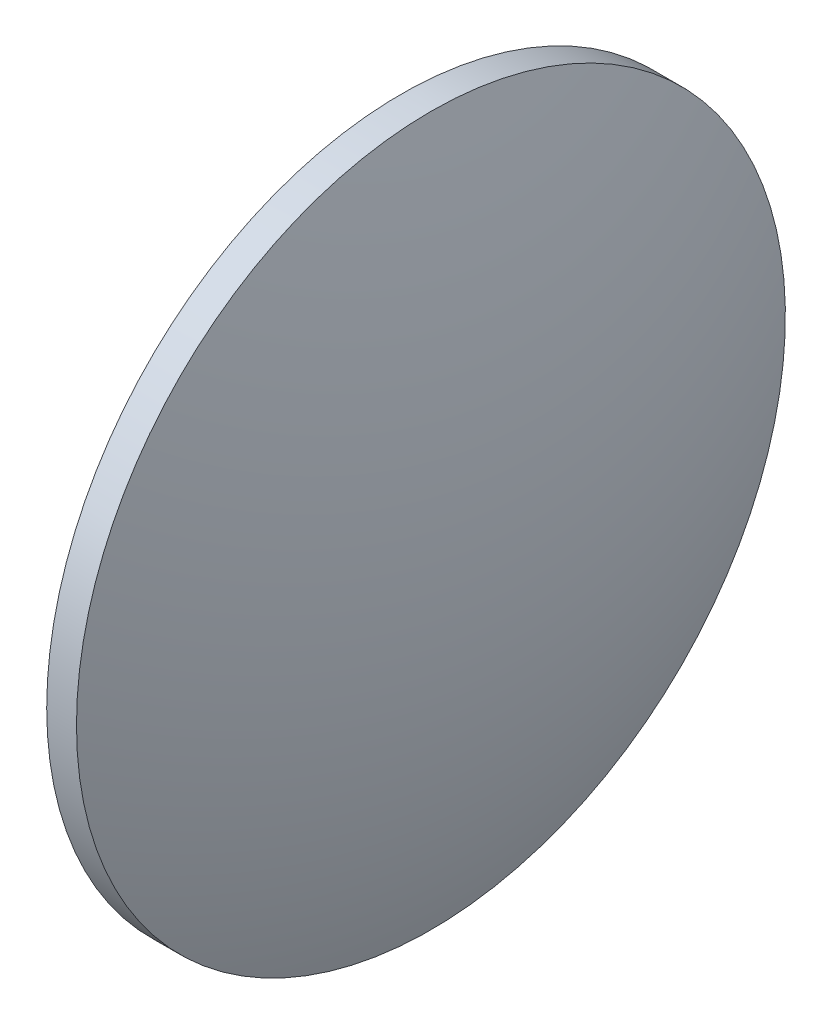
ISO-10303-21;
HEADER;
FILE_DESCRIPTION(('STEP AP214'),'2;1');
FILE_NAME('part.step','',(''),(''),'','','');
FILE_SCHEMA(('AUTOMOTIVE_DESIGN { 1 0 10303 214 1 1 1 1 }'));
ENDSEC;
DATA;
#1=APPLICATION_CONTEXT('core data for automotive mechanical design processes');
#2=APPLICATION_PROTOCOL_DEFINITION('international standard','automotive_design',2000,#1);
#3=PRODUCT_CONTEXT('',#1,'mechanical');
#4=PRODUCT('Part','Part','',(#3));
#5=PRODUCT_RELATED_PRODUCT_CATEGORY('part','',(#4));
#6=PRODUCT_DEFINITION_FORMATION('','',#4);
#7=PRODUCT_DEFINITION_CONTEXT('part definition',#1,'design');
#8=PRODUCT_DEFINITION('design','',#6,#7);
#9=PRODUCT_DEFINITION_SHAPE('','',#8);
#10=(LENGTH_UNIT() NAMED_UNIT(*) SI_UNIT(.MILLI.,.METRE.));
#11=(NAMED_UNIT(*) PLANE_ANGLE_UNIT() SI_UNIT($,.RADIAN.));
#12=(NAMED_UNIT(*) SI_UNIT($,.STERADIAN.) SOLID_ANGLE_UNIT());
#13=UNCERTAINTY_MEASURE_WITH_UNIT(LENGTH_MEASURE(1.E-05),#10,'distance_accuracy_value','');
#14=(GEOMETRIC_REPRESENTATION_CONTEXT(3) GLOBAL_UNCERTAINTY_ASSIGNED_CONTEXT((#13)) GLOBAL_UNIT_ASSIGNED_CONTEXT((#10,
#11,#12)) REPRESENTATION_CONTEXT('',''));
#15=CARTESIAN_POINT('',(0.,0.,0.));
#16=DIRECTION('',(0.,0.,1.));
#17=DIRECTION('',(1.,0.,0.));
#18=AXIS2_PLACEMENT_3D('',#15,#16,#17);
#19=CARTESIAN_POINT('',(387.333817231009,60.46347484046,0.));
#20=DIRECTION('',(-1.,0.,0.));
#21=DIRECTION('',(0.,1.,0.));
#22=AXIS2_PLACEMENT_3D('',#19,#20,#21);
#23=SPHERICAL_SURFACE('',#22,62.2297030878861);
#24=CARTESIAN_POINT('',(445.353520318895,60.46347484046,0.));
#25=DIRECTION('',(-1.,0.,0.));
#26=DIRECTION('',(0.,0.,1.));
#27=AXIS2_PLACEMENT_3D('',#24,#25,#26);
#28=CIRCLE('',#27,22.5);
#29=CARTESIAN_POINT('',(445.353520318895,60.46347484046,22.5));
#30=VERTEX_POINT('',#29);
#31=EDGE_CURVE('E10',#30,#30,#28,.T.);
#32=ORIENTED_EDGE('',*,*,#31,.F.);
#33=EDGE_LOOP('',(#32));
#34=FACE_BOUND('',#33,.T.);
#35=ADVANCED_FACE('F35',(#34),#23,.T.);
#36=CARTESIAN_POINT('',(434.028740433742,60.46347484046,0.));
#37=DIRECTION('',(-1.,0.,0.));
#38=DIRECTION('',(0.,0.,1.));
#39=AXIS2_PLACEMENT_3D('',#36,#37,#38);
#40=CYLINDRICAL_SURFACE('',#39,22.5);
#41=CARTESIAN_POINT('',(443.463520318895,60.46347484046,0.));
#42=DIRECTION('',(-1.,0.,0.));
#43=DIRECTION('',(0.,0.,1.));
#44=AXIS2_PLACEMENT_3D('',#41,#42,#43);
#45=CIRCLE('',#44,22.5);
#46=CARTESIAN_POINT('',(443.463520318895,60.46347484046,22.5));
#47=VERTEX_POINT('',#46);
#48=EDGE_CURVE('E41',#47,#47,#45,.T.);
#49=ORIENTED_EDGE('',*,*,#48,.F.);
#50=EDGE_LOOP('',(#49));
#51=FACE_BOUND('',#50,.T.);
#52=ORIENTED_EDGE('',*,*,#31,.T.);
#53=EDGE_LOOP('',(#52));
#54=FACE_BOUND('',#53,.T.);
#55=ADVANCED_FACE('F49',(#51,#54),#40,.T.);
#56=CARTESIAN_POINT('',(443.463520318895,60.46347484046,0.));
#57=DIRECTION('',(1.,0.,0.));
#58=DIRECTION('',(0.,0.,-1.));
#59=AXIS2_PLACEMENT_3D('',#56,#57,#58);
#60=PLANE('',#59);
#61=ORIENTED_EDGE('',*,*,#48,.T.);
#62=EDGE_LOOP('',(#61));
#63=FACE_BOUND('',#62,.T.);
#64=ADVANCED_FACE('F47',(#63),#60,.F.);
#65=CLOSED_SHELL('',(#35,#55,#64));
#66=MANIFOLD_SOLID_BREP('B2',#65);
#67=ADVANCED_BREP_SHAPE_REPRESENTATION('',(#18,#66),#14);
#68=SHAPE_DEFINITION_REPRESENTATION(#9,#67);
ENDSEC;
END-ISO-10303-21;
